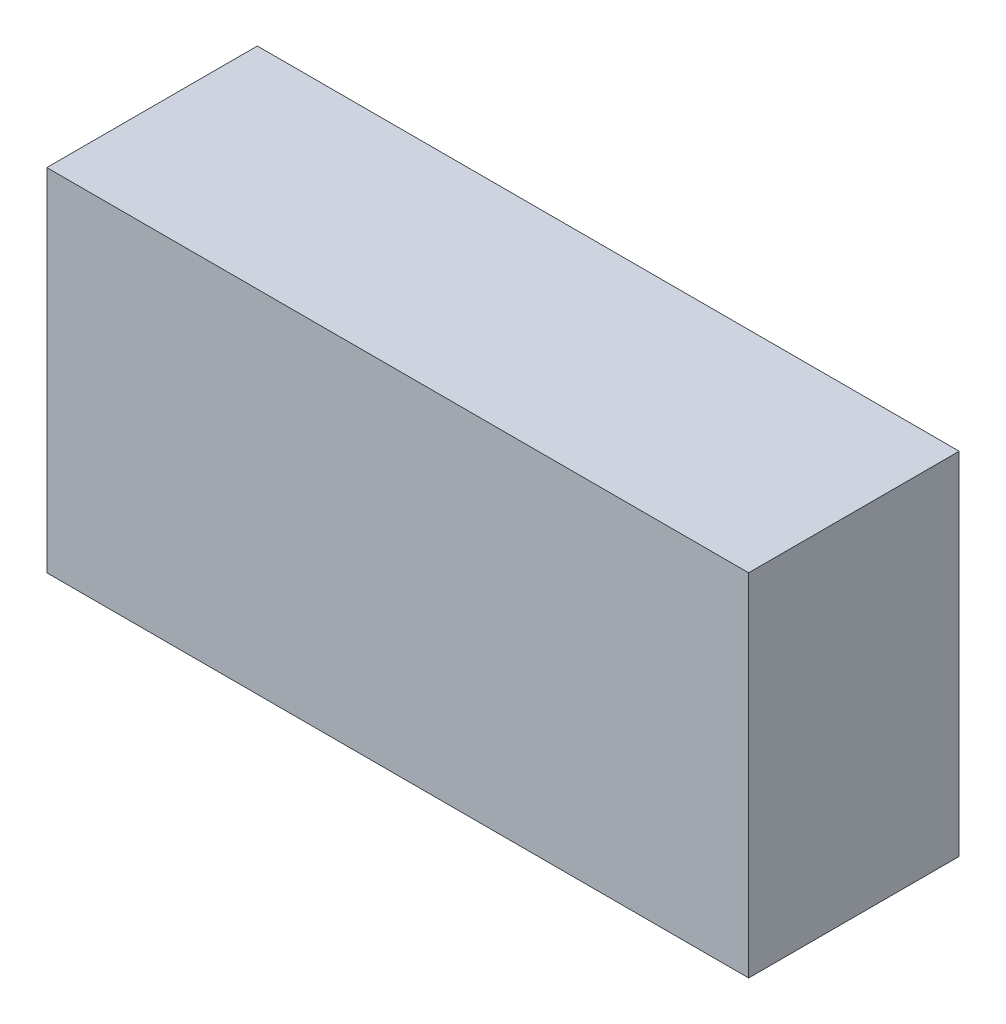
ISO-10303-21;
HEADER;
FILE_DESCRIPTION(('STEP AP214'),'2;1');
FILE_NAME('part.step','',(''),(''),'','','');
FILE_SCHEMA(('AUTOMOTIVE_DESIGN { 1 0 10303 214 1 1 1 1 }'));
ENDSEC;
DATA;
#1=APPLICATION_CONTEXT('core data for automotive mechanical design processes');
#2=APPLICATION_PROTOCOL_DEFINITION('international standard','automotive_design',2000,#1);
#3=PRODUCT_CONTEXT('',#1,'mechanical');
#4=PRODUCT('Part','Part','',(#3));
#5=PRODUCT_RELATED_PRODUCT_CATEGORY('part','',(#4));
#6=PRODUCT_DEFINITION_FORMATION('','',#4);
#7=PRODUCT_DEFINITION_CONTEXT('part definition',#1,'design');
#8=PRODUCT_DEFINITION('design','',#6,#7);
#9=PRODUCT_DEFINITION_SHAPE('','',#8);
#10=(LENGTH_UNIT() NAMED_UNIT(*) SI_UNIT(.MILLI.,.METRE.));
#11=(NAMED_UNIT(*) PLANE_ANGLE_UNIT() SI_UNIT($,.RADIAN.));
#12=(NAMED_UNIT(*) SI_UNIT($,.STERADIAN.) SOLID_ANGLE_UNIT());
#13=UNCERTAINTY_MEASURE_WITH_UNIT(LENGTH_MEASURE(1.E-05),#10,'distance_accuracy_value','');
#14=(GEOMETRIC_REPRESENTATION_CONTEXT(3) GLOBAL_UNCERTAINTY_ASSIGNED_CONTEXT((#13)) GLOBAL_UNIT_ASSIGNED_CONTEXT((#10,
#11,#12)) REPRESENTATION_CONTEXT('',''));
#15=CARTESIAN_POINT('',(0.,0.,0.));
#16=DIRECTION('',(0.,0.,1.));
#17=DIRECTION('',(1.,0.,0.));
#18=AXIS2_PLACEMENT_3D('',#15,#16,#17);
#19=CARTESIAN_POINT('',(0.,0.,24.));
#20=DIRECTION('',(1.,0.,0.));
#21=DIRECTION('',(0.,1.,0.));
#22=AXIS2_PLACEMENT_3D('',#19,#20,#21);
#23=PLANE('',#22);
#24=DIRECTION('',(0.,-1.,0.));
#25=VECTOR('',#24,1.);
#26=CARTESIAN_POINT('',(0.,0.,0.));
#27=LINE('',#26,#25);
#28=CARTESIAN_POINT('',(0.,0.,0.));
#29=VERTEX_POINT('',#28);
#30=CARTESIAN_POINT('',(0.,-40.,0.));
#31=VERTEX_POINT('',#30);
#32=EDGE_CURVE('E100',#29,#31,#27,.T.);
#33=ORIENTED_EDGE('',*,*,#32,.T.);
#34=DIRECTION('',(0.,0.,-1.));
#35=VECTOR('',#34,1.);
#36=CARTESIAN_POINT('',(0.,-40.,24.));
#37=LINE('',#36,#35);
#38=CARTESIAN_POINT('',(0.,-40.,24.));
#39=VERTEX_POINT('',#38);
#40=EDGE_CURVE('E11',#39,#31,#37,.T.);
#41=ORIENTED_EDGE('',*,*,#40,.F.);
#42=DIRECTION('',(0.,-1.,0.));
#43=VECTOR('',#42,1.);
#44=CARTESIAN_POINT('',(0.,0.,24.));
#45=LINE('',#44,#43);
#46=CARTESIAN_POINT('',(0.,0.,24.));
#47=VERTEX_POINT('',#46);
#48=EDGE_CURVE('E88',#47,#39,#45,.T.);
#49=ORIENTED_EDGE('',*,*,#48,.F.);
#50=DIRECTION('',(0.,0.,-1.));
#51=VECTOR('',#50,1.);
#52=CARTESIAN_POINT('',(0.,0.,24.));
#53=LINE('',#52,#51);
#54=EDGE_CURVE('E96',#47,#29,#53,.T.);
#55=ORIENTED_EDGE('',*,*,#54,.T.);
#56=EDGE_LOOP('',(#33,#41,#49,#55));
#57=FACE_BOUND('',#56,.T.);
#58=ADVANCED_FACE('F37',(#57),#23,.F.);
#59=CARTESIAN_POINT('',(0.,-40.,24.));
#60=DIRECTION('',(0.,1.,0.));
#61=DIRECTION('',(0.,0.,1.));
#62=AXIS2_PLACEMENT_3D('',#59,#60,#61);
#63=PLANE('',#62);
#64=DIRECTION('',(1.,0.,0.));
#65=VECTOR('',#64,1.);
#66=CARTESIAN_POINT('',(0.,-40.,0.));
#67=LINE('',#66,#65);
#68=CARTESIAN_POINT('',(80.,-40.,0.));
#69=VERTEX_POINT('',#68);
#70=EDGE_CURVE('E92',#31,#69,#67,.T.);
#71=ORIENTED_EDGE('',*,*,#70,.T.);
#72=DIRECTION('',(0.,0.,-1.));
#73=VECTOR('',#72,1.);
#74=CARTESIAN_POINT('',(80.,-40.,24.));
#75=LINE('',#74,#73);
#76=CARTESIAN_POINT('',(80.,-40.,24.));
#77=VERTEX_POINT('',#76);
#78=EDGE_CURVE('E45',#77,#69,#75,.T.);
#79=ORIENTED_EDGE('',*,*,#78,.F.);
#80=DIRECTION('',(1.,0.,0.));
#81=VECTOR('',#80,1.);
#82=CARTESIAN_POINT('',(0.,-40.,24.));
#83=LINE('',#82,#81);
#84=EDGE_CURVE('E83',#39,#77,#83,.T.);
#85=ORIENTED_EDGE('',*,*,#84,.F.);
#86=ORIENTED_EDGE('',*,*,#40,.T.);
#87=EDGE_LOOP('',(#71,#79,#85,#86));
#88=FACE_BOUND('',#87,.T.);
#89=ADVANCED_FACE('F91',(#88),#63,.F.);
#90=CARTESIAN_POINT('',(80.,0.,24.));
#91=DIRECTION('',(-1.,0.,0.));
#92=DIRECTION('',(0.,0.,1.));
#93=AXIS2_PLACEMENT_3D('',#90,#91,#92);
#94=PLANE('',#93);
#95=DIRECTION('',(0.,1.,0.));
#96=VECTOR('',#95,1.);
#97=CARTESIAN_POINT('',(80.,0.,0.));
#98=LINE('',#97,#96);
#99=CARTESIAN_POINT('',(80.,0.,0.));
#100=VERTEX_POINT('',#99);
#101=EDGE_CURVE('E70',#69,#100,#98,.T.);
#102=ORIENTED_EDGE('',*,*,#101,.T.);
#103=DIRECTION('',(0.,0.,-1.));
#104=VECTOR('',#103,1.);
#105=CARTESIAN_POINT('',(80.,0.,24.));
#106=LINE('',#105,#104);
#107=CARTESIAN_POINT('',(80.,0.,24.));
#108=VERTEX_POINT('',#107);
#109=EDGE_CURVE('E93',#108,#100,#106,.T.);
#110=ORIENTED_EDGE('',*,*,#109,.F.);
#111=DIRECTION('',(0.,1.,0.));
#112=VECTOR('',#111,1.);
#113=CARTESIAN_POINT('',(80.,0.,24.));
#114=LINE('',#113,#112);
#115=EDGE_CURVE('E86',#77,#108,#114,.T.);
#116=ORIENTED_EDGE('',*,*,#115,.F.);
#117=ORIENTED_EDGE('',*,*,#78,.T.);
#118=EDGE_LOOP('',(#102,#110,#116,#117));
#119=FACE_BOUND('',#118,.T.);
#120=ADVANCED_FACE('F94',(#119),#94,.F.);
#121=CARTESIAN_POINT('',(0.,0.,24.));
#122=DIRECTION('',(0.,-1.,0.));
#123=DIRECTION('',(0.,0.,-1.));
#124=AXIS2_PLACEMENT_3D('',#121,#122,#123);
#125=PLANE('',#124);
#126=DIRECTION('',(-1.,0.,0.));
#127=VECTOR('',#126,1.);
#128=CARTESIAN_POINT('',(0.,0.,0.));
#129=LINE('',#128,#127);
#130=EDGE_CURVE('E76',#100,#29,#129,.T.);
#131=ORIENTED_EDGE('',*,*,#130,.T.);
#132=ORIENTED_EDGE('',*,*,#54,.F.);
#133=DIRECTION('',(-1.,0.,0.));
#134=VECTOR('',#133,1.);
#135=CARTESIAN_POINT('',(0.,0.,24.));
#136=LINE('',#135,#134);
#137=EDGE_CURVE('E53',#108,#47,#136,.T.);
#138=ORIENTED_EDGE('',*,*,#137,.F.);
#139=ORIENTED_EDGE('',*,*,#109,.T.);
#140=EDGE_LOOP('',(#131,#132,#138,#139));
#141=FACE_BOUND('',#140,.T.);
#142=ADVANCED_FACE('F107',(#141),#125,.F.);
#143=CARTESIAN_POINT('',(0.,0.,24.));
#144=DIRECTION('',(0.,0.,1.));
#145=DIRECTION('',(1.,0.,0.));
#146=AXIS2_PLACEMENT_3D('',#143,#144,#145);
#147=PLANE('',#146);
#148=ORIENTED_EDGE('',*,*,#48,.T.);
#149=ORIENTED_EDGE('',*,*,#84,.T.);
#150=ORIENTED_EDGE('',*,*,#115,.T.);
#151=ORIENTED_EDGE('',*,*,#137,.T.);
#152=EDGE_LOOP('',(#148,#149,#150,#151));
#153=FACE_BOUND('',#152,.T.);
#154=ADVANCED_FACE('F84',(#153),#147,.T.);
#155=CARTESIAN_POINT('',(0.,0.,0.));
#156=DIRECTION('',(0.,0.,1.));
#157=DIRECTION('',(1.,0.,0.));
#158=AXIS2_PLACEMENT_3D('',#155,#156,#157);
#159=PLANE('',#158);
#160=ORIENTED_EDGE('',*,*,#32,.F.);
#161=ORIENTED_EDGE('',*,*,#130,.F.);
#162=ORIENTED_EDGE('',*,*,#101,.F.);
#163=ORIENTED_EDGE('',*,*,#70,.F.);
#164=EDGE_LOOP('',(#160,#161,#162,#163));
#165=FACE_BOUND('',#164,.T.);
#166=ADVANCED_FACE('F110',(#165),#159,.F.);
#167=CLOSED_SHELL('',(#58,#89,#120,#142,#154,#166));
#168=MANIFOLD_SOLID_BREP('B2',#167);
#169=ADVANCED_BREP_SHAPE_REPRESENTATION('',(#18,#168),#14);
#170=SHAPE_DEFINITION_REPRESENTATION(#9,#169);
ENDSEC;
END-ISO-10303-21;
